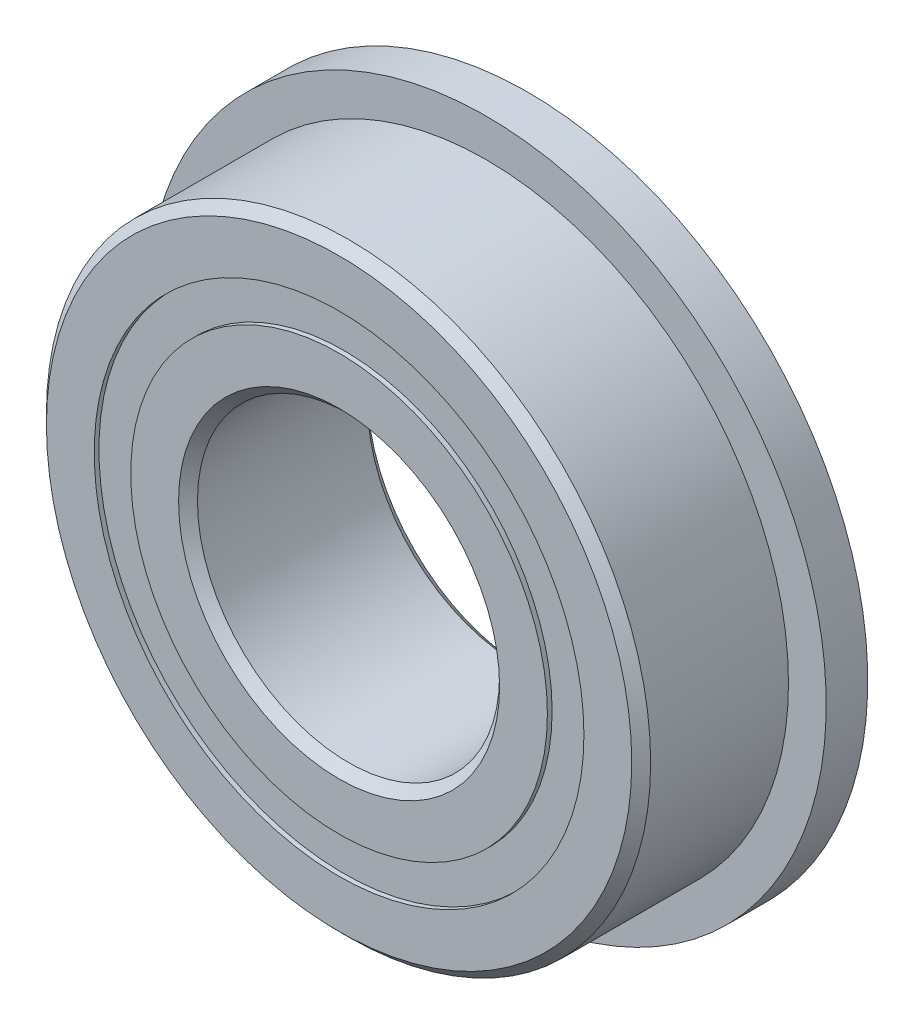
ISO-10303-21;
HEADER;
FILE_DESCRIPTION(('STEP AP214'),'2;1');
FILE_NAME('part.step','',(''),(''),'','','');
FILE_SCHEMA(('AUTOMOTIVE_DESIGN { 1 0 10303 214 1 1 1 1 }'));
ENDSEC;
DATA;
#1=APPLICATION_CONTEXT('core data for automotive mechanical design processes');
#2=APPLICATION_PROTOCOL_DEFINITION('international standard','automotive_design',2000,#1);
#3=PRODUCT_CONTEXT('',#1,'mechanical');
#4=PRODUCT('Part','Part','',(#3));
#5=PRODUCT_RELATED_PRODUCT_CATEGORY('part','',(#4));
#6=PRODUCT_DEFINITION_FORMATION('','',#4);
#7=PRODUCT_DEFINITION_CONTEXT('part definition',#1,'design');
#8=PRODUCT_DEFINITION('design','',#6,#7);
#9=PRODUCT_DEFINITION_SHAPE('','',#8);
#10=(LENGTH_UNIT() NAMED_UNIT(*) SI_UNIT(.MILLI.,.METRE.));
#11=(NAMED_UNIT(*) PLANE_ANGLE_UNIT() SI_UNIT($,.RADIAN.));
#12=(NAMED_UNIT(*) SI_UNIT($,.STERADIAN.) SOLID_ANGLE_UNIT());
#13=UNCERTAINTY_MEASURE_WITH_UNIT(LENGTH_MEASURE(1.E-05),#10,'distance_accuracy_value','');
#14=(GEOMETRIC_REPRESENTATION_CONTEXT(3) GLOBAL_UNCERTAINTY_ASSIGNED_CONTEXT((#13)) GLOBAL_UNIT_ASSIGNED_CONTEXT((#10,
#11,#12)) REPRESENTATION_CONTEXT('',''));
#15=CARTESIAN_POINT('',(0.,0.,0.));
#16=DIRECTION('',(0.,0.,1.));
#17=DIRECTION('',(1.,0.,0.));
#18=AXIS2_PLACEMENT_3D('',#15,#16,#17);
#19=CARTESIAN_POINT('',(0.,6.48351648351649,-2.375));
#20=DIRECTION('',(0.,0.,1.));
#21=DIRECTION('',(1.,0.,0.));
#22=AXIS2_PLACEMENT_3D('',#19,#20,#21);
#23=PLANE('',#22);
#24=CARTESIAN_POINT('',(0.,0.,-2.375));
#25=DIRECTION('',(0.,0.,1.));
#26=DIRECTION('',(1.,0.,0.));
#27=AXIS2_PLACEMENT_3D('',#24,#25,#26);
#28=CIRCLE('',#27,6.48351648351649);
#29=CARTESIAN_POINT('',(6.48351648351649,0.,-2.375));
#30=VERTEX_POINT('',#29);
#31=EDGE_CURVE('E55',#30,#30,#28,.T.);
#32=ORIENTED_EDGE('',*,*,#31,.F.);
#33=EDGE_LOOP('',(#32));
#34=FACE_BOUND('',#33,.T.);
#35=CARTESIAN_POINT('',(0.,0.,-2.375));
#36=DIRECTION('',(0.,0.,1.));
#37=DIRECTION('',(1.,0.,0.));
#38=AXIS2_PLACEMENT_3D('',#35,#36,#37);
#39=CIRCLE('',#38,5.51648351648352);
#40=CARTESIAN_POINT('',(5.51648351648352,0.,-2.375));
#41=VERTEX_POINT('',#40);
#42=EDGE_CURVE('E11',#41,#41,#39,.T.);
#43=ORIENTED_EDGE('',*,*,#42,.T.);
#44=EDGE_LOOP('',(#43));
#45=FACE_BOUND('',#44,.T.);
#46=ADVANCED_FACE('F41',(#34,#45),#23,.F.);
#47=CARTESIAN_POINT('',(0.,0.,2.5));
#48=DIRECTION('',(0.,0.,1.));
#49=DIRECTION('',(1.,0.,0.));
#50=AXIS2_PLACEMENT_3D('',#47,#48,#49);
#51=CYLINDRICAL_SURFACE('',#50,5.51648351648352);
#52=ORIENTED_EDGE('',*,*,#42,.F.);
#53=EDGE_LOOP('',(#52));
#54=FACE_BOUND('',#53,.T.);
#55=CARTESIAN_POINT('',(0.,0.,-1.21175743903915));
#56=DIRECTION('',(0.,0.,1.));
#57=DIRECTION('',(1.,0.,0.));
#58=AXIS2_PLACEMENT_3D('',#55,#56,#57);
#59=CIRCLE('',#58,5.51648351648352);
#60=CARTESIAN_POINT('',(5.51648351648352,0.,-1.21175743903915));
#61=VERTEX_POINT('',#60);
#62=EDGE_CURVE('E47',#61,#61,#59,.T.);
#63=ORIENTED_EDGE('',*,*,#62,.T.);
#64=EDGE_LOOP('',(#63));
#65=FACE_BOUND('',#64,.T.);
#66=ADVANCED_FACE('F64',(#54,#65),#51,.F.);
#67=CARTESIAN_POINT('',(0.,6.48351648351648,-1.21175743903915));
#68=DIRECTION('',(0.,0.,-1.));
#69=DIRECTION('',(-1.,0.,0.));
#70=AXIS2_PLACEMENT_3D('',#67,#68,#69);
#71=PLANE('',#70);
#72=ORIENTED_EDGE('',*,*,#62,.F.);
#73=EDGE_LOOP('',(#72));
#74=FACE_BOUND('',#73,.T.);
#75=CARTESIAN_POINT('',(0.,0.,-1.21175743903915));
#76=DIRECTION('',(0.,0.,1.));
#77=DIRECTION('',(1.,0.,0.));
#78=AXIS2_PLACEMENT_3D('',#75,#76,#77);
#79=CIRCLE('',#78,6.48351648351648);
#80=CARTESIAN_POINT('',(6.48351648351648,0.,-1.21175743903915));
#81=VERTEX_POINT('',#80);
#82=EDGE_CURVE('E51',#81,#81,#79,.T.);
#83=ORIENTED_EDGE('',*,*,#82,.T.);
#84=EDGE_LOOP('',(#83));
#85=FACE_BOUND('',#84,.T.);
#86=ADVANCED_FACE('F68',(#74,#85),#71,.F.);
#87=CARTESIAN_POINT('',(0.,0.,2.5));
#88=DIRECTION('',(0.,0.,1.));
#89=DIRECTION('',(1.,0.,0.));
#90=AXIS2_PLACEMENT_3D('',#87,#88,#89);
#91=CYLINDRICAL_SURFACE('',#90,6.48351648351649);
#92=ORIENTED_EDGE('',*,*,#82,.F.);
#93=EDGE_LOOP('',(#92));
#94=FACE_BOUND('',#93,.T.);
#95=ORIENTED_EDGE('',*,*,#31,.T.);
#96=EDGE_LOOP('',(#95));
#97=FACE_BOUND('',#96,.T.);
#98=ADVANCED_FACE('F61',(#94,#97),#91,.T.);
#99=CLOSED_SHELL('',(#46,#66,#86,#98));
#100=MANIFOLD_SOLID_BREP('B2',#99);
#101=CARTESIAN_POINT('',(0.,6.48351648351648,2.375));
#102=DIRECTION('',(0.,0.,-1.));
#103=DIRECTION('',(-1.,0.,0.));
#104=AXIS2_PLACEMENT_3D('',#101,#102,#103);
#105=PLANE('',#104);
#106=CARTESIAN_POINT('',(0.,0.,2.375));
#107=DIRECTION('',(0.,0.,1.));
#108=DIRECTION('',(1.,0.,0.));
#109=AXIS2_PLACEMENT_3D('',#106,#107,#108);
#110=CIRCLE('',#109,5.51648351648352);
#111=CARTESIAN_POINT('',(5.51648351648352,0.,2.375));
#112=VERTEX_POINT('',#111);
#113=EDGE_CURVE('E40',#112,#112,#110,.T.);
#114=ORIENTED_EDGE('',*,*,#113,.F.);
#115=EDGE_LOOP('',(#114));
#116=FACE_BOUND('',#115,.T.);
#117=CARTESIAN_POINT('',(0.,0.,2.375));
#118=DIRECTION('',(0.,0.,1.));
#119=DIRECTION('',(1.,0.,0.));
#120=AXIS2_PLACEMENT_3D('',#117,#118,#119);
#121=CIRCLE('',#120,6.48351648351648);
#122=CARTESIAN_POINT('',(6.48351648351648,0.,2.375));
#123=VERTEX_POINT('',#122);
#124=EDGE_CURVE('E122',#123,#123,#121,.T.);
#125=ORIENTED_EDGE('',*,*,#124,.T.);
#126=EDGE_LOOP('',(#125));
#127=FACE_BOUND('',#126,.T.);
#128=ADVANCED_FACE('F108',(#116,#127),#105,.F.);
#129=CARTESIAN_POINT('',(0.,0.,2.5));
#130=DIRECTION('',(0.,0.,1.));
#131=DIRECTION('',(1.,0.,0.));
#132=AXIS2_PLACEMENT_3D('',#129,#130,#131);
#133=CYLINDRICAL_SURFACE('',#132,5.51648351648352);
#134=CARTESIAN_POINT('',(0.,0.,1.21175743903915));
#135=DIRECTION('',(0.,0.,1.));
#136=DIRECTION('',(1.,0.,0.));
#137=AXIS2_PLACEMENT_3D('',#134,#135,#136);
#138=CIRCLE('',#137,5.51648351648352);
#139=CARTESIAN_POINT('',(5.51648351648352,0.,1.21175743903915));
#140=VERTEX_POINT('',#139);
#141=EDGE_CURVE('E114',#140,#140,#138,.T.);
#142=ORIENTED_EDGE('',*,*,#141,.F.);
#143=EDGE_LOOP('',(#142));
#144=FACE_BOUND('',#143,.T.);
#145=ORIENTED_EDGE('',*,*,#113,.T.);
#146=EDGE_LOOP('',(#145));
#147=FACE_BOUND('',#146,.T.);
#148=ADVANCED_FACE('F137',(#144,#147),#133,.F.);
#149=CARTESIAN_POINT('',(0.,6.48351648351648,1.21175743903915));
#150=DIRECTION('',(0.,0.,1.));
#151=DIRECTION('',(1.,0.,0.));
#152=AXIS2_PLACEMENT_3D('',#149,#150,#151);
#153=PLANE('',#152);
#154=CARTESIAN_POINT('',(0.,0.,1.21175743903915));
#155=DIRECTION('',(0.,0.,1.));
#156=DIRECTION('',(1.,0.,0.));
#157=AXIS2_PLACEMENT_3D('',#154,#155,#156);
#158=CIRCLE('',#157,6.48351648351648);
#159=CARTESIAN_POINT('',(6.48351648351648,0.,1.21175743903915));
#160=VERTEX_POINT('',#159);
#161=EDGE_CURVE('E118',#160,#160,#158,.T.);
#162=ORIENTED_EDGE('',*,*,#161,.F.);
#163=EDGE_LOOP('',(#162));
#164=FACE_BOUND('',#163,.T.);
#165=ORIENTED_EDGE('',*,*,#141,.T.);
#166=EDGE_LOOP('',(#165));
#167=FACE_BOUND('',#166,.T.);
#168=ADVANCED_FACE('F132',(#164,#167),#153,.F.);
#169=CARTESIAN_POINT('',(0.,0.,2.5));
#170=DIRECTION('',(0.,0.,1.));
#171=DIRECTION('',(1.,0.,0.));
#172=AXIS2_PLACEMENT_3D('',#169,#170,#171);
#173=CYLINDRICAL_SURFACE('',#172,6.48351648351648);
#174=ORIENTED_EDGE('',*,*,#124,.F.);
#175=EDGE_LOOP('',(#174));
#176=FACE_BOUND('',#175,.T.);
#177=ORIENTED_EDGE('',*,*,#161,.T.);
#178=EDGE_LOOP('',(#177));
#179=FACE_BOUND('',#178,.T.);
#180=ADVANCED_FACE('F129',(#176,#179),#173,.T.);
#181=CLOSED_SHELL('',(#128,#148,#168,#180));
#182=MANIFOLD_SOLID_BREP('B6',#181);
#183=CARTESIAN_POINT('',(-2.99999999999993,5.19615242270667,0.));
#184=DIRECTION('',(0.,0.,1.));
#185=DIRECTION('',(-0.499999999999989,0.866025403784445,0.));
#186=AXIS2_PLACEMENT_3D('',#183,#184,#185);
#187=SPHERICAL_SURFACE('',#186,1.21175743903915);
#188=CARTESIAN_POINT('',(-2.99999999999993,5.19615242270667,1.21175743903915));
#189=VERTEX_POINT('',#188);
#190=VERTEX_LOOP('',#189);
#191=FACE_BOUND('',#190,.T.);
#192=ADVANCED_FACE('F175',(#191),#187,.T.);
#193=CLOSED_SHELL('',(#192));
#194=MANIFOLD_SOLID_BREP('B35',#193);
#195=CARTESIAN_POINT('',(-5.1961524227066,3.00000000000006,0.));
#196=DIRECTION('',(0.,0.,1.));
#197=DIRECTION('',(-0.866025403784433,0.50000000000001,0.));
#198=AXIS2_PLACEMENT_3D('',#195,#196,#197);
#199=SPHERICAL_SURFACE('',#198,1.21175743903915);
#200=CARTESIAN_POINT('',(-5.1961524227066,3.00000000000006,1.21175743903915));
#201=VERTEX_POINT('',#200);
#202=VERTEX_LOOP('',#201);
#203=FACE_BOUND('',#202,.T.);
#204=ADVANCED_FACE('F195',(#203),#199,.T.);
#205=CLOSED_SHELL('',(#204));
#206=MANIFOLD_SOLID_BREP('B104',#205);
#207=CARTESIAN_POINT('',(-6.,0.,0.));
#208=DIRECTION('',(0.,0.,1.));
#209=DIRECTION('',(-1.,0.,0.));
#210=AXIS2_PLACEMENT_3D('',#207,#208,#209);
#211=SPHERICAL_SURFACE('',#210,1.21175743903915);
#212=CARTESIAN_POINT('',(-6.,0.,1.21175743903915));
#213=VERTEX_POINT('',#212);
#214=VERTEX_LOOP('',#213);
#215=FACE_BOUND('',#214,.T.);
#216=ADVANCED_FACE('F215',(#215),#211,.T.);
#217=CLOSED_SHELL('',(#216));
#218=MANIFOLD_SOLID_BREP('B171',#217);
#219=CARTESIAN_POINT('',(-5.19615242270666,-2.99999999999995,0.));
#220=DIRECTION('',(0.,0.,1.));
#221=DIRECTION('',(-0.866025403784443,-0.499999999999992,0.));
#222=AXIS2_PLACEMENT_3D('',#219,#220,#221);
#223=SPHERICAL_SURFACE('',#222,1.21175743903915);
#224=CARTESIAN_POINT('',(-5.19615242270666,-2.99999999999995,1.21175743903915));
#225=VERTEX_POINT('',#224);
#226=VERTEX_LOOP('',#225);
#227=FACE_BOUND('',#226,.T.);
#228=ADVANCED_FACE('F235',(#227),#223,.T.);
#229=CLOSED_SHELL('',(#228));
#230=MANIFOLD_SOLID_BREP('B191',#229);
#231=CARTESIAN_POINT('',(-3.00000000000004,-5.19615242270661,0.));
#232=DIRECTION('',(0.,0.,1.));
#233=DIRECTION('',(-0.500000000000007,-0.866025403784435,0.));
#234=AXIS2_PLACEMENT_3D('',#231,#232,#233);
#235=SPHERICAL_SURFACE('',#234,1.21175743903915);
#236=CARTESIAN_POINT('',(-3.00000000000004,-5.19615242270661,1.21175743903915));
#237=VERTEX_POINT('',#236);
#238=VERTEX_LOOP('',#237);
#239=FACE_BOUND('',#238,.T.);
#240=ADVANCED_FACE('F255',(#239),#235,.T.);
#241=CLOSED_SHELL('',(#240));
#242=MANIFOLD_SOLID_BREP('B211',#241);
#243=CARTESIAN_POINT('',(0.,-6.,0.));
#244=DIRECTION('',(0.,0.,1.));
#245=DIRECTION('',(0.,-1.,0.));
#246=AXIS2_PLACEMENT_3D('',#243,#244,#245);
#247=SPHERICAL_SURFACE('',#246,1.21175743903915);
#248=CARTESIAN_POINT('',(0.,-6.,1.21175743903915));
#249=VERTEX_POINT('',#248);
#250=VERTEX_LOOP('',#249);
#251=FACE_BOUND('',#250,.T.);
#252=ADVANCED_FACE('F275',(#251),#247,.T.);
#253=CLOSED_SHELL('',(#252));
#254=MANIFOLD_SOLID_BREP('B231',#253);
#255=CARTESIAN_POINT('',(2.99999999999997,-5.19615242270665,0.));
#256=DIRECTION('',(0.,0.,1.));
#257=DIRECTION('',(0.499999999999995,-0.866025403784442,0.));
#258=AXIS2_PLACEMENT_3D('',#255,#256,#257);
#259=SPHERICAL_SURFACE('',#258,1.21175743903915);
#260=CARTESIAN_POINT('',(2.99999999999997,-5.19615242270665,1.21175743903915));
#261=VERTEX_POINT('',#260);
#262=VERTEX_LOOP('',#261);
#263=FACE_BOUND('',#262,.T.);
#264=ADVANCED_FACE('F295',(#263),#259,.T.);
#265=CLOSED_SHELL('',(#264));
#266=MANIFOLD_SOLID_BREP('B251',#265);
#267=CARTESIAN_POINT('',(5.19615242270662,-3.00000000000002,0.));
#268=DIRECTION('',(0.,0.,1.));
#269=DIRECTION('',(0.866025403784436,-0.500000000000004,0.));
#270=AXIS2_PLACEMENT_3D('',#267,#268,#269);
#271=SPHERICAL_SURFACE('',#270,1.21175743903915);
#272=CARTESIAN_POINT('',(5.19615242270662,-3.00000000000002,1.21175743903915));
#273=VERTEX_POINT('',#272);
#274=VERTEX_LOOP('',#273);
#275=FACE_BOUND('',#274,.T.);
#276=ADVANCED_FACE('F315',(#275),#271,.T.);
#277=CLOSED_SHELL('',(#276));
#278=MANIFOLD_SOLID_BREP('B271',#277);
#279=CARTESIAN_POINT('',(6.,0.,0.));
#280=DIRECTION('',(0.,0.,1.));
#281=DIRECTION('',(1.,0.,0.));
#282=AXIS2_PLACEMENT_3D('',#279,#280,#281);
#283=SPHERICAL_SURFACE('',#282,1.21175743903915);
#284=CARTESIAN_POINT('',(6.,0.,1.21175743903915));
#285=VERTEX_POINT('',#284);
#286=VERTEX_LOOP('',#285);
#287=FACE_BOUND('',#286,.T.);
#288=ADVANCED_FACE('F335',(#287),#283,.T.);
#289=CLOSED_SHELL('',(#288));
#290=MANIFOLD_SOLID_BREP('B291',#289);
#291=CARTESIAN_POINT('',(5.19615242270664,2.99999999999999,0.));
#292=DIRECTION('',(0.,0.,1.));
#293=DIRECTION('',(0.86602540378444,0.499999999999998,0.));
#294=AXIS2_PLACEMENT_3D('',#291,#292,#293);
#295=SPHERICAL_SURFACE('',#294,1.21175743903915);
#296=CARTESIAN_POINT('',(5.19615242270664,2.99999999999999,1.21175743903915));
#297=VERTEX_POINT('',#296);
#298=VERTEX_LOOP('',#297);
#299=FACE_BOUND('',#298,.T.);
#300=ADVANCED_FACE('F355',(#299),#295,.T.);
#301=CLOSED_SHELL('',(#300));
#302=MANIFOLD_SOLID_BREP('B311',#301);
#303=CARTESIAN_POINT('',(3.00000000000001,5.19615242270663,0.));
#304=DIRECTION('',(0.,0.,1.));
#305=DIRECTION('',(0.500000000000001,0.866025403784438,0.));
#306=AXIS2_PLACEMENT_3D('',#303,#304,#305);
#307=SPHERICAL_SURFACE('',#306,1.21175743903915);
#308=CARTESIAN_POINT('',(3.00000000000001,5.19615242270663,1.21175743903915));
#309=VERTEX_POINT('',#308);
#310=VERTEX_LOOP('',#309);
#311=FACE_BOUND('',#310,.T.);
#312=ADVANCED_FACE('F375',(#311),#307,.T.);
#313=CLOSED_SHELL('',(#312));
#314=MANIFOLD_SOLID_BREP('B331',#313);
#315=CARTESIAN_POINT('',(0.,6.,0.));
#316=DIRECTION('',(0.,0.,1.));
#317=DIRECTION('',(0.,1.,0.));
#318=AXIS2_PLACEMENT_3D('',#315,#316,#317);
#319=SPHERICAL_SURFACE('',#318,1.21175743903915);
#320=CARTESIAN_POINT('',(0.,6.,1.21175743903915));
#321=VERTEX_POINT('',#320);
#322=VERTEX_LOOP('',#321);
#323=FACE_BOUND('',#322,.T.);
#324=ADVANCED_FACE('F397',(#323),#319,.T.);
#325=CLOSED_SHELL('',(#324));
#326=MANIFOLD_SOLID_BREP('B351',#325);
#327=CARTESIAN_POINT('',(0.,5.51648351648352,2.5));
#328=DIRECTION('',(0.,0.,-1.));
#329=DIRECTION('',(-1.,0.,0.));
#330=AXIS2_PLACEMENT_3D('',#327,#328,#329);
#331=PLANE('',#330);
#332=CARTESIAN_POINT('',(0.,0.,2.5));
#333=DIRECTION('',(0.,0.,1.));
#334=DIRECTION('',(1.,0.,0.));
#335=AXIS2_PLACEMENT_3D('',#332,#333,#334);
#336=CIRCLE('',#335,4.25);
#337=CARTESIAN_POINT('',(4.25,0.,2.5));
#338=VERTEX_POINT('',#337);
#339=EDGE_CURVE('E444',#338,#338,#336,.T.);
#340=ORIENTED_EDGE('',*,*,#339,.F.);
#341=EDGE_LOOP('',(#340));
#342=FACE_BOUND('',#341,.T.);
#343=CARTESIAN_POINT('',(0.,0.,2.5));
#344=DIRECTION('',(0.,0.,1.));
#345=DIRECTION('',(1.,0.,0.));
#346=AXIS2_PLACEMENT_3D('',#343,#344,#345);
#347=CIRCLE('',#346,5.51648351648352);
#348=CARTESIAN_POINT('',(5.51648351648352,0.,2.5));
#349=VERTEX_POINT('',#348);
#350=EDGE_CURVE('E396',#349,#349,#347,.T.);
#351=ORIENTED_EDGE('',*,*,#350,.T.);
#352=EDGE_LOOP('',(#351));
#353=FACE_BOUND('',#352,.T.);
#354=ADVANCED_FACE('F416',(#342,#353),#331,.F.);
#355=CARTESIAN_POINT('',(0.,0.,2.5));
#356=DIRECTION('',(0.,0.,1.));
#357=DIRECTION('',(1.,0.,0.));
#358=AXIS2_PLACEMENT_3D('',#355,#356,#357);
#359=CYLINDRICAL_SURFACE('',#358,5.51648351648352);
#360=ORIENTED_EDGE('',*,*,#350,.F.);
#361=EDGE_LOOP('',(#360));
#362=FACE_BOUND('',#361,.T.);
#363=CARTESIAN_POINT('',(0.,0.,1.11111111111111));
#364=DIRECTION('',(0.,0.,1.));
#365=DIRECTION('',(1.,0.,0.));
#366=AXIS2_PLACEMENT_3D('',#363,#364,#365);
#367=CIRCLE('',#366,5.51648351648352);
#368=CARTESIAN_POINT('',(5.51648351648352,0.,1.11111111111111));
#369=VERTEX_POINT('',#368);
#370=EDGE_CURVE('E422',#369,#369,#367,.T.);
#371=ORIENTED_EDGE('',*,*,#370,.T.);
#372=EDGE_LOOP('',(#371));
#373=FACE_BOUND('',#372,.T.);
#374=ADVANCED_FACE('F451',(#362,#373),#359,.T.);
#375=CARTESIAN_POINT('',(0.,0.,0.));
#376=DIRECTION('',(0.,0.,1.));
#377=DIRECTION('',(1.,0.,0.));
#378=AXIS2_PLACEMENT_3D('',#375,#376,#377);
#379=TOROIDAL_SURFACE('',#378,6.,1.21175743903915);
#380=ORIENTED_EDGE('',*,*,#370,.F.);
#381=EDGE_LOOP('',(#380));
#382=FACE_BOUND('',#381,.T.);
#383=CARTESIAN_POINT('',(0.,0.,-1.11111111111111));
#384=DIRECTION('',(0.,0.,1.));
#385=DIRECTION('',(1.,0.,0.));
#386=AXIS2_PLACEMENT_3D('',#383,#384,#385);
#387=CIRCLE('',#386,5.51648351648352);
#388=CARTESIAN_POINT('',(5.51648351648352,0.,-1.11111111111111));
#389=VERTEX_POINT('',#388);
#390=EDGE_CURVE('E426',#389,#389,#387,.T.);
#391=ORIENTED_EDGE('',*,*,#390,.T.);
#392=EDGE_LOOP('',(#391));
#393=FACE_BOUND('',#392,.T.);
#394=ADVANCED_FACE('F455',(#382,#393),#379,.F.);
#395=CARTESIAN_POINT('',(0.,0.,2.5));
#396=DIRECTION('',(0.,0.,1.));
#397=DIRECTION('',(1.,0.,0.));
#398=AXIS2_PLACEMENT_3D('',#395,#396,#397);
#399=CYLINDRICAL_SURFACE('',#398,5.51648351648352);
#400=ORIENTED_EDGE('',*,*,#390,.F.);
#401=EDGE_LOOP('',(#400));
#402=FACE_BOUND('',#401,.T.);
#403=CARTESIAN_POINT('',(0.,0.,-2.5));
#404=DIRECTION('',(0.,0.,1.));
#405=DIRECTION('',(1.,0.,0.));
#406=AXIS2_PLACEMENT_3D('',#403,#404,#405);
#407=CIRCLE('',#406,5.51648351648352);
#408=CARTESIAN_POINT('',(5.51648351648352,0.,-2.5));
#409=VERTEX_POINT('',#408);
#410=EDGE_CURVE('E430',#409,#409,#407,.T.);
#411=ORIENTED_EDGE('',*,*,#410,.T.);
#412=EDGE_LOOP('',(#411));
#413=FACE_BOUND('',#412,.T.);
#414=ADVANCED_FACE('F460',(#402,#413),#399,.T.);
#415=CARTESIAN_POINT('',(0.,4.25,-2.5));
#416=DIRECTION('',(0.,0.,1.));
#417=DIRECTION('',(1.,0.,0.));
#418=AXIS2_PLACEMENT_3D('',#415,#416,#417);
#419=PLANE('',#418);
#420=ORIENTED_EDGE('',*,*,#410,.F.);
#421=EDGE_LOOP('',(#420));
#422=FACE_BOUND('',#421,.T.);
#423=CARTESIAN_POINT('',(0.,0.,-2.5));
#424=DIRECTION('',(0.,0.,1.));
#425=DIRECTION('',(1.,0.,0.));
#426=AXIS2_PLACEMENT_3D('',#423,#424,#425);
#427=CIRCLE('',#426,4.25);
#428=CARTESIAN_POINT('',(4.25,0.,-2.5));
#429=VERTEX_POINT('',#428);
#430=EDGE_CURVE('E435',#429,#429,#427,.T.);
#431=ORIENTED_EDGE('',*,*,#430,.T.);
#432=EDGE_LOOP('',(#431));
#433=FACE_BOUND('',#432,.T.);
#434=ADVANCED_FACE('F466',(#422,#433),#419,.F.);
#435=CARTESIAN_POINT('',(0.,0.,-2.25));
#436=DIRECTION('',(0.,0.,-1.));
#437=DIRECTION('',(-1.,0.,0.));
#438=AXIS2_PLACEMENT_3D('',#435,#436,#437);
#439=CONICAL_SURFACE('',#438,4.,0.785398163397443);
#440=ORIENTED_EDGE('',*,*,#430,.F.);
#441=EDGE_LOOP('',(#440));
#442=FACE_BOUND('',#441,.T.);
#443=CARTESIAN_POINT('',(0.,0.,-2.25));
#444=DIRECTION('',(0.,0.,1.));
#445=DIRECTION('',(1.,0.,0.));
#446=AXIS2_PLACEMENT_3D('',#443,#444,#445);
#447=CIRCLE('',#446,4.);
#448=CARTESIAN_POINT('',(4.,0.,-2.25));
#449=VERTEX_POINT('',#448);
#450=EDGE_CURVE('E438',#449,#449,#447,.T.);
#451=ORIENTED_EDGE('',*,*,#450,.T.);
#452=EDGE_LOOP('',(#451));
#453=FACE_BOUND('',#452,.T.);
#454=ADVANCED_FACE('F470',(#442,#453),#439,.F.);
#455=CARTESIAN_POINT('',(0.,0.,2.5));
#456=DIRECTION('',(0.,0.,1.));
#457=DIRECTION('',(1.,0.,0.));
#458=AXIS2_PLACEMENT_3D('',#455,#456,#457);
#459=CYLINDRICAL_SURFACE('',#458,4.);
#460=ORIENTED_EDGE('',*,*,#450,.F.);
#461=EDGE_LOOP('',(#460));
#462=FACE_BOUND('',#461,.T.);
#463=CARTESIAN_POINT('',(0.,0.,2.25));
#464=DIRECTION('',(0.,0.,1.));
#465=DIRECTION('',(1.,0.,0.));
#466=AXIS2_PLACEMENT_3D('',#463,#464,#465);
#467=CIRCLE('',#466,4.);
#468=CARTESIAN_POINT('',(4.,0.,2.25));
#469=VERTEX_POINT('',#468);
#470=EDGE_CURVE('E441',#469,#469,#467,.T.);
#471=ORIENTED_EDGE('',*,*,#470,.T.);
#472=EDGE_LOOP('',(#471));
#473=FACE_BOUND('',#472,.T.);
#474=ADVANCED_FACE('F474',(#462,#473),#459,.F.);
#475=CARTESIAN_POINT('',(0.,0.,2.5));
#476=DIRECTION('',(0.,0.,1.));
#477=DIRECTION('',(1.,0.,0.));
#478=AXIS2_PLACEMENT_3D('',#475,#476,#477);
#479=CONICAL_SURFACE('',#478,4.25,0.785398163397453);
#480=ORIENTED_EDGE('',*,*,#470,.F.);
#481=EDGE_LOOP('',(#480));
#482=FACE_BOUND('',#481,.T.);
#483=ORIENTED_EDGE('',*,*,#339,.T.);
#484=EDGE_LOOP('',(#483));
#485=FACE_BOUND('',#484,.T.);
#486=ADVANCED_FACE('F448',(#482,#485),#479,.F.);
#487=CLOSED_SHELL('',(#354,#374,#394,#414,#434,#454,#474,#486));
#488=MANIFOLD_SOLID_BREP('B371',#487);
#489=CARTESIAN_POINT('',(0.,0.,2.25));
#490=DIRECTION('',(0.,0.,-1.));
#491=DIRECTION('',(-1.,0.,0.));
#492=AXIS2_PLACEMENT_3D('',#489,#490,#491);
#493=CONICAL_SURFACE('',#492,8.,0.785398163397446);
#494=CARTESIAN_POINT('',(0.,0.,2.5));
#495=DIRECTION('',(0.,0.,1.));
#496=DIRECTION('',(1.,0.,0.));
#497=AXIS2_PLACEMENT_3D('',#494,#495,#496);
#498=CIRCLE('',#497,7.75);
#499=CARTESIAN_POINT('',(7.75,0.,2.5));
#500=VERTEX_POINT('',#499);
#501=EDGE_CURVE('E559',#500,#500,#498,.T.);
#502=ORIENTED_EDGE('',*,*,#501,.F.);
#503=EDGE_LOOP('',(#502));
#504=FACE_BOUND('',#503,.T.);
#505=CARTESIAN_POINT('',(0.,0.,2.25));
#506=DIRECTION('',(0.,0.,1.));
#507=DIRECTION('',(1.,0.,0.));
#508=AXIS2_PLACEMENT_3D('',#505,#506,#507);
#509=CIRCLE('',#508,8.);
#510=CARTESIAN_POINT('',(8.,0.,2.25));
#511=VERTEX_POINT('',#510);
#512=EDGE_CURVE('E415',#511,#511,#509,.T.);
#513=ORIENTED_EDGE('',*,*,#512,.T.);
#514=EDGE_LOOP('',(#513));
#515=FACE_BOUND('',#514,.T.);
#516=ADVANCED_FACE('F537',(#504,#515),#493,.T.);
#517=CARTESIAN_POINT('',(0.,0.,2.5));
#518=DIRECTION('',(0.,0.,1.));
#519=DIRECTION('',(1.,0.,0.));
#520=AXIS2_PLACEMENT_3D('',#517,#518,#519);
#521=CYLINDRICAL_SURFACE('',#520,8.);
#522=CARTESIAN_POINT('',(0.,0.,-1.4));
#523=DIRECTION('',(0.,0.,1.));
#524=DIRECTION('',(1.,0.,0.));
#525=AXIS2_PLACEMENT_3D('',#522,#523,#524);
#526=CIRCLE('',#525,8.);
#527=CARTESIAN_POINT('',(8.,0.,-1.4));
#528=VERTEX_POINT('',#527);
#529=EDGE_CURVE('E562',#528,#528,#526,.T.);
#530=ORIENTED_EDGE('',*,*,#529,.T.);
#531=EDGE_LOOP('',(#530));
#532=FACE_BOUND('',#531,.T.);
#533=ORIENTED_EDGE('',*,*,#512,.F.);
#534=EDGE_LOOP('',(#533));
#535=FACE_BOUND('',#534,.T.);
#536=ADVANCED_FACE('F582',(#532,#535),#521,.T.);
#537=CARTESIAN_POINT('',(0.,7.75,-2.5));
#538=DIRECTION('',(0.,0.,1.));
#539=DIRECTION('',(1.,0.,0.));
#540=AXIS2_PLACEMENT_3D('',#537,#538,#539);
#541=PLANE('',#540);
#542=CARTESIAN_POINT('',(0.,0.,-2.5));
#543=DIRECTION('',(0.,0.,1.));
#544=DIRECTION('',(1.,0.,0.));
#545=AXIS2_PLACEMENT_3D('',#542,#543,#544);
#546=CIRCLE('',#545,6.48351648351648);
#547=CARTESIAN_POINT('',(6.48351648351648,0.,-2.5));
#548=VERTEX_POINT('',#547);
#549=EDGE_CURVE('E543',#548,#548,#546,.T.);
#550=ORIENTED_EDGE('',*,*,#549,.T.);
#551=EDGE_LOOP('',(#550));
#552=FACE_BOUND('',#551,.T.);
#553=CARTESIAN_POINT('',(0.,0.,-2.5));
#554=DIRECTION('',(0.,0.,-1.));
#555=DIRECTION('',(-1.,0.,0.));
#556=AXIS2_PLACEMENT_3D('',#553,#554,#555);
#557=CIRCLE('',#556,9.);
#558=CARTESIAN_POINT('',(-9.,0.,-2.5));
#559=VERTEX_POINT('',#558);
#560=EDGE_CURVE('E565',#559,#559,#557,.T.);
#561=ORIENTED_EDGE('',*,*,#560,.T.);
#562=EDGE_LOOP('',(#561));
#563=FACE_BOUND('',#562,.T.);
#564=ADVANCED_FACE('F585',(#552,#563),#541,.F.);
#565=CARTESIAN_POINT('',(0.,0.,2.5));
#566=DIRECTION('',(0.,0.,1.));
#567=DIRECTION('',(1.,0.,0.));
#568=AXIS2_PLACEMENT_3D('',#565,#566,#567);
#569=CYLINDRICAL_SURFACE('',#568,6.48351648351648);
#570=CARTESIAN_POINT('',(0.,0.,-1.11111111111111));
#571=DIRECTION('',(0.,0.,1.));
#572=DIRECTION('',(1.,0.,0.));
#573=AXIS2_PLACEMENT_3D('',#570,#571,#572);
#574=CIRCLE('',#573,6.48351648351648);
#575=CARTESIAN_POINT('',(6.48351648351648,0.,-1.11111111111111));
#576=VERTEX_POINT('',#575);
#577=EDGE_CURVE('E547',#576,#576,#574,.T.);
#578=ORIENTED_EDGE('',*,*,#577,.T.);
#579=EDGE_LOOP('',(#578));
#580=FACE_BOUND('',#579,.T.);
#581=ORIENTED_EDGE('',*,*,#549,.F.);
#582=EDGE_LOOP('',(#581));
#583=FACE_BOUND('',#582,.T.);
#584=ADVANCED_FACE('F590',(#580,#583),#569,.F.);
#585=CARTESIAN_POINT('',(0.,0.,0.));
#586=DIRECTION('',(0.,0.,1.));
#587=DIRECTION('',(1.,0.,0.));
#588=AXIS2_PLACEMENT_3D('',#585,#586,#587);
#589=TOROIDAL_SURFACE('',#588,6.,1.21175743903915);
#590=ORIENTED_EDGE('',*,*,#577,.F.);
#591=EDGE_LOOP('',(#590));
#592=FACE_BOUND('',#591,.T.);
#593=CARTESIAN_POINT('',(0.,0.,1.11111111111111));
#594=DIRECTION('',(0.,0.,1.));
#595=DIRECTION('',(1.,0.,0.));
#596=AXIS2_PLACEMENT_3D('',#593,#594,#595);
#597=CIRCLE('',#596,6.48351648351648);
#598=CARTESIAN_POINT('',(6.48351648351648,0.,1.11111111111111));
#599=VERTEX_POINT('',#598);
#600=EDGE_CURVE('E551',#599,#599,#597,.T.);
#601=ORIENTED_EDGE('',*,*,#600,.T.);
#602=EDGE_LOOP('',(#601));
#603=FACE_BOUND('',#602,.T.);
#604=ADVANCED_FACE('F596',(#592,#603),#589,.F.);
#605=CARTESIAN_POINT('',(0.,0.,2.5));
#606=DIRECTION('',(0.,0.,1.));
#607=DIRECTION('',(1.,0.,0.));
#608=AXIS2_PLACEMENT_3D('',#605,#606,#607);
#609=CYLINDRICAL_SURFACE('',#608,6.48351648351648);
#610=ORIENTED_EDGE('',*,*,#600,.F.);
#611=EDGE_LOOP('',(#610));
#612=FACE_BOUND('',#611,.T.);
#613=CARTESIAN_POINT('',(0.,0.,2.5));
#614=DIRECTION('',(0.,0.,1.));
#615=DIRECTION('',(1.,0.,0.));
#616=AXIS2_PLACEMENT_3D('',#613,#614,#615);
#617=CIRCLE('',#616,6.48351648351648);
#618=CARTESIAN_POINT('',(6.48351648351648,0.,2.5));
#619=VERTEX_POINT('',#618);
#620=EDGE_CURVE('E556',#619,#619,#617,.T.);
#621=ORIENTED_EDGE('',*,*,#620,.T.);
#622=EDGE_LOOP('',(#621));
#623=FACE_BOUND('',#622,.T.);
#624=ADVANCED_FACE('F600',(#612,#623),#609,.F.);
#625=CARTESIAN_POINT('',(0.,7.75,2.5));
#626=DIRECTION('',(0.,0.,-1.));
#627=DIRECTION('',(-1.,0.,0.));
#628=AXIS2_PLACEMENT_3D('',#625,#626,#627);
#629=PLANE('',#628);
#630=ORIENTED_EDGE('',*,*,#620,.F.);
#631=EDGE_LOOP('',(#630));
#632=FACE_BOUND('',#631,.T.);
#633=ORIENTED_EDGE('',*,*,#501,.T.);
#634=EDGE_LOOP('',(#633));
#635=FACE_BOUND('',#634,.T.);
#636=ADVANCED_FACE('F578',(#632,#635),#629,.F.);
#637=CARTESIAN_POINT('',(0.,6.48351648351648,-1.4));
#638=DIRECTION('',(0.,0.,1.));
#639=DIRECTION('',(1.,0.,0.));
#640=AXIS2_PLACEMENT_3D('',#637,#638,#639);
#641=PLANE('',#640);
#642=CARTESIAN_POINT('',(0.,0.,-1.4));
#643=DIRECTION('',(0.,0.,-1.));
#644=DIRECTION('',(-1.,0.,0.));
#645=AXIS2_PLACEMENT_3D('',#642,#643,#644);
#646=CIRCLE('',#645,9.);
#647=CARTESIAN_POINT('',(-9.,0.,-1.4));
#648=VERTEX_POINT('',#647);
#649=EDGE_CURVE('E568',#648,#648,#646,.T.);
#650=ORIENTED_EDGE('',*,*,#649,.F.);
#651=EDGE_LOOP('',(#650));
#652=FACE_BOUND('',#651,.T.);
#653=ORIENTED_EDGE('',*,*,#529,.F.);
#654=EDGE_LOOP('',(#653));
#655=FACE_BOUND('',#654,.T.);
#656=ADVANCED_FACE('F575',(#652,#655),#641,.T.);
#657=CARTESIAN_POINT('',(0.,0.,-2.5));
#658=DIRECTION('',(0.,0.,-1.));
#659=DIRECTION('',(-1.,0.,0.));
#660=AXIS2_PLACEMENT_3D('',#657,#658,#659);
#661=CYLINDRICAL_SURFACE('',#660,9.);
#662=ORIENTED_EDGE('',*,*,#649,.T.);
#663=EDGE_LOOP('',(#662));
#664=FACE_BOUND('',#663,.T.);
#665=ORIENTED_EDGE('',*,*,#560,.F.);
#666=EDGE_LOOP('',(#665));
#667=FACE_BOUND('',#666,.T.);
#668=ADVANCED_FACE('F572',(#664,#667),#661,.T.);
#669=CLOSED_SHELL('',(#516,#536,#564,#584,#604,#624,#636,#656,#668));
#670=MANIFOLD_SOLID_BREP('B391',#669);
#671=ADVANCED_BREP_SHAPE_REPRESENTATION('',(#18,#100,#182,#194,#206,#218,#230,#242,#254,#266,
#278,#290,#302,#314,#326,#488,#670),#14);
#672=SHAPE_DEFINITION_REPRESENTATION(#9,#671);
ENDSEC;
END-ISO-10303-21;
